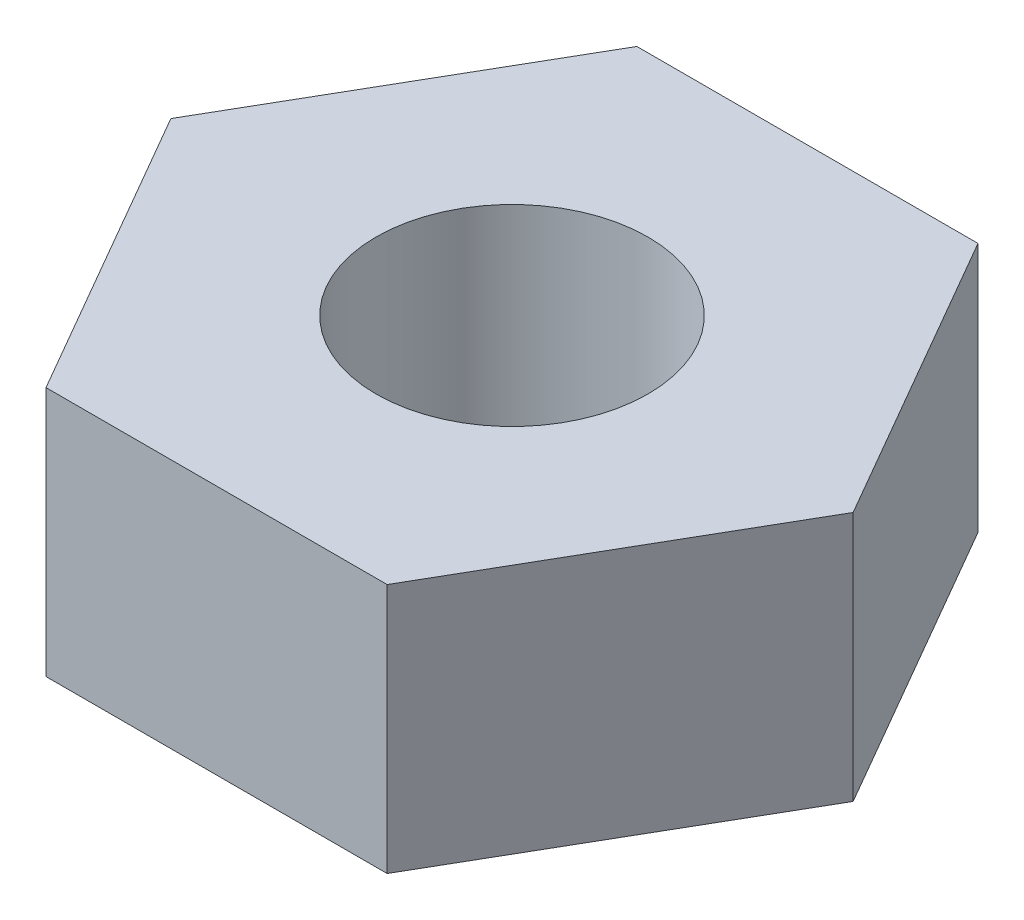
ISO-10303-21;
HEADER;
FILE_DESCRIPTION(('STEP AP214'),'2;1');
FILE_NAME('part.step','',(''),(''),'','','');
FILE_SCHEMA(('AUTOMOTIVE_DESIGN { 1 0 10303 214 1 1 1 1 }'));
ENDSEC;
DATA;
#1=APPLICATION_CONTEXT('core data for automotive mechanical design processes');
#2=APPLICATION_PROTOCOL_DEFINITION('international standard','automotive_design',2000,#1);
#3=PRODUCT_CONTEXT('',#1,'mechanical');
#4=PRODUCT('Part','Part','',(#3));
#5=PRODUCT_RELATED_PRODUCT_CATEGORY('part','',(#4));
#6=PRODUCT_DEFINITION_FORMATION('','',#4);
#7=PRODUCT_DEFINITION_CONTEXT('part definition',#1,'design');
#8=PRODUCT_DEFINITION('design','',#6,#7);
#9=PRODUCT_DEFINITION_SHAPE('','',#8);
#10=(LENGTH_UNIT() NAMED_UNIT(*) SI_UNIT(.MILLI.,.METRE.));
#11=(NAMED_UNIT(*) PLANE_ANGLE_UNIT() SI_UNIT($,.RADIAN.));
#12=(NAMED_UNIT(*) SI_UNIT($,.STERADIAN.) SOLID_ANGLE_UNIT());
#13=UNCERTAINTY_MEASURE_WITH_UNIT(LENGTH_MEASURE(1.E-05),#10,'distance_accuracy_value','');
#14=(GEOMETRIC_REPRESENTATION_CONTEXT(3) GLOBAL_UNCERTAINTY_ASSIGNED_CONTEXT((#13)) GLOBAL_UNIT_ASSIGNED_CONTEXT((#10,
#11,#12)) REPRESENTATION_CONTEXT('',''));
#15=CARTESIAN_POINT('',(0.,0.,0.));
#16=DIRECTION('',(0.,0.,1.));
#17=DIRECTION('',(1.,0.,0.));
#18=AXIS2_PLACEMENT_3D('',#15,#16,#17);
#19=CARTESIAN_POINT('',(0.,2.3,0.));
#20=DIRECTION('',(0.,1.,0.));
#21=DIRECTION('',(0.,0.,1.));
#22=AXIS2_PLACEMENT_3D('',#19,#20,#21);
#23=PLANE('',#22);
#24=DIRECTION('',(0.499999999999995,0.,-0.866025403784442));
#25=VECTOR('',#24,1.);
#26=CARTESIAN_POINT('',(1.56750598084987,2.3,2.71499999999998));
#27=LINE('',#26,#25);
#28=CARTESIAN_POINT('',(1.56750598084987,2.3,2.71499999999998));
#29=VERTEX_POINT('',#28);
#30=CARTESIAN_POINT('',(3.13501196169967,2.3,0.));
#31=VERTEX_POINT('',#30);
#32=EDGE_CURVE('E146',#29,#31,#27,.T.);
#33=ORIENTED_EDGE('',*,*,#32,.T.);
#34=DIRECTION('',(-0.500000000000001,0.,-0.866025403784438));
#35=VECTOR('',#34,1.);
#36=CARTESIAN_POINT('',(3.13501196169967,2.3,0.));
#37=LINE('',#36,#35);
#38=CARTESIAN_POINT('',(1.56750598084983,2.3,-2.71500000000001));
#39=VERTEX_POINT('',#38);
#40=EDGE_CURVE('E94',#31,#39,#37,.T.);
#41=ORIENTED_EDGE('',*,*,#40,.T.);
#42=DIRECTION('',(-1.,0.,0.));
#43=VECTOR('',#42,1.);
#44=CARTESIAN_POINT('',(1.56750598084983,2.3,-2.71500000000001));
#45=LINE('',#44,#43);
#46=CARTESIAN_POINT('',(-1.56750598084985,2.3,-2.715));
#47=VERTEX_POINT('',#46);
#48=EDGE_CURVE('E107',#39,#47,#45,.T.);
#49=ORIENTED_EDGE('',*,*,#48,.T.);
#50=DIRECTION('',(-0.499999999999995,0.,0.866025403784441));
#51=VECTOR('',#50,1.);
#52=CARTESIAN_POINT('',(-1.56750598084985,2.3,-2.715));
#53=LINE('',#52,#51);
#54=CARTESIAN_POINT('',(-3.13501196169967,2.3,0.));
#55=VERTEX_POINT('',#54);
#56=EDGE_CURVE('E101',#47,#55,#53,.T.);
#57=ORIENTED_EDGE('',*,*,#56,.T.);
#58=DIRECTION('',(0.500000000000007,0.,0.866025403784435));
#59=VECTOR('',#58,1.);
#60=CARTESIAN_POINT('',(-3.13501196169967,2.3,0.));
#61=LINE('',#60,#59);
#62=CARTESIAN_POINT('',(-1.56750598084981,2.3,2.71500000000002));
#63=VERTEX_POINT('',#62);
#64=EDGE_CURVE('E105',#55,#63,#61,.T.);
#65=ORIENTED_EDGE('',*,*,#64,.T.);
#66=DIRECTION('',(1.,0.,0.));
#67=VECTOR('',#66,1.);
#68=CARTESIAN_POINT('',(-1.56750598084981,2.3,2.71500000000002));
#69=LINE('',#68,#67);
#70=EDGE_CURVE('E57',#63,#29,#69,.T.);
#71=ORIENTED_EDGE('',*,*,#70,.T.);
#72=EDGE_LOOP('',(#33,#41,#49,#57,#65,#71));
#73=FACE_BOUND('',#72,.T.);
#74=CARTESIAN_POINT('',(0.,2.3,0.));
#75=DIRECTION('',(0.,1.,0.));
#76=DIRECTION('',(0.,0.,1.));
#77=AXIS2_PLACEMENT_3D('',#74,#75,#76);
#78=CIRCLE('',#77,1.25);
#79=CARTESIAN_POINT('',(0.,2.3,1.25));
#80=VERTEX_POINT('',#79);
#81=EDGE_CURVE('E134',#80,#80,#78,.T.);
#82=ORIENTED_EDGE('',*,*,#81,.F.);
#83=EDGE_LOOP('',(#82));
#84=FACE_BOUND('',#83,.T.);
#85=ADVANCED_FACE('F39',(#73,#84),#23,.T.);
#86=CARTESIAN_POINT('',(0.,0.,0.));
#87=DIRECTION('',(0.,1.,0.));
#88=DIRECTION('',(0.,0.,1.));
#89=AXIS2_PLACEMENT_3D('',#86,#87,#88);
#90=PLANE('',#89);
#91=DIRECTION('',(0.499999999999995,0.,-0.866025403784442));
#92=VECTOR('',#91,1.);
#93=CARTESIAN_POINT('',(1.56750598084987,0.,2.71499999999998));
#94=LINE('',#93,#92);
#95=CARTESIAN_POINT('',(1.56750598084987,0.,2.71499999999998));
#96=VERTEX_POINT('',#95);
#97=CARTESIAN_POINT('',(3.13501196169967,0.,0.));
#98=VERTEX_POINT('',#97);
#99=EDGE_CURVE('E129',#96,#98,#94,.T.);
#100=ORIENTED_EDGE('',*,*,#99,.F.);
#101=DIRECTION('',(1.,0.,0.));
#102=VECTOR('',#101,1.);
#103=CARTESIAN_POINT('',(-1.56750598084981,0.,2.71500000000002));
#104=LINE('',#103,#102);
#105=CARTESIAN_POINT('',(-1.56750598084981,0.,2.71500000000002));
#106=VERTEX_POINT('',#105);
#107=EDGE_CURVE('E86',#106,#96,#104,.T.);
#108=ORIENTED_EDGE('',*,*,#107,.F.);
#109=DIRECTION('',(0.500000000000007,0.,0.866025403784435));
#110=VECTOR('',#109,1.);
#111=CARTESIAN_POINT('',(-3.13501196169967,0.,0.));
#112=LINE('',#111,#110);
#113=CARTESIAN_POINT('',(-3.13501196169967,0.,0.));
#114=VERTEX_POINT('',#113);
#115=EDGE_CURVE('E80',#114,#106,#112,.T.);
#116=ORIENTED_EDGE('',*,*,#115,.F.);
#117=DIRECTION('',(-0.499999999999995,0.,0.866025403784441));
#118=VECTOR('',#117,1.);
#119=CARTESIAN_POINT('',(-1.56750598084985,0.,-2.715));
#120=LINE('',#119,#118);
#121=CARTESIAN_POINT('',(-1.56750598084985,0.,-2.715));
#122=VERTEX_POINT('',#121);
#123=EDGE_CURVE('E116',#122,#114,#120,.T.);
#124=ORIENTED_EDGE('',*,*,#123,.F.);
#125=DIRECTION('',(-1.,0.,0.));
#126=VECTOR('',#125,1.);
#127=CARTESIAN_POINT('',(1.56750598084983,0.,-2.71500000000001));
#128=LINE('',#127,#126);
#129=CARTESIAN_POINT('',(1.56750598084983,0.,-2.71500000000001));
#130=VERTEX_POINT('',#129);
#131=EDGE_CURVE('E137',#130,#122,#128,.T.);
#132=ORIENTED_EDGE('',*,*,#131,.F.);
#133=DIRECTION('',(-0.500000000000001,0.,-0.866025403784438));
#134=VECTOR('',#133,1.);
#135=CARTESIAN_POINT('',(3.13501196169967,0.,0.));
#136=LINE('',#135,#134);
#137=EDGE_CURVE('E133',#98,#130,#136,.T.);
#138=ORIENTED_EDGE('',*,*,#137,.F.);
#139=EDGE_LOOP('',(#100,#108,#116,#124,#132,#138));
#140=FACE_BOUND('',#139,.T.);
#141=CARTESIAN_POINT('',(0.,0.,0.));
#142=DIRECTION('',(0.,1.,0.));
#143=DIRECTION('',(0.,0.,1.));
#144=AXIS2_PLACEMENT_3D('',#141,#142,#143);
#145=CIRCLE('',#144,1.25);
#146=CARTESIAN_POINT('',(0.,0.,1.25));
#147=VERTEX_POINT('',#146);
#148=EDGE_CURVE('E243',#147,#147,#145,.T.);
#149=ORIENTED_EDGE('',*,*,#148,.T.);
#150=EDGE_LOOP('',(#149));
#151=FACE_BOUND('',#150,.T.);
#152=ADVANCED_FACE('F159',(#140,#151),#90,.F.);
#153=CARTESIAN_POINT('',(1.56750598084987,2.3,2.71499999999998));
#154=DIRECTION('',(-0.866025403784441,0.,-0.499999999999995));
#155=DIRECTION('',(-0.499999999999995,0.,0.866025403784442));
#156=AXIS2_PLACEMENT_3D('',#153,#154,#155);
#157=PLANE('',#156);
#158=ORIENTED_EDGE('',*,*,#99,.T.);
#159=DIRECTION('',(0.,-1.,0.));
#160=VECTOR('',#159,1.);
#161=CARTESIAN_POINT('',(3.13501196169967,2.3,0.));
#162=LINE('',#161,#160);
#163=EDGE_CURVE('E11',#31,#98,#162,.T.);
#164=ORIENTED_EDGE('',*,*,#163,.F.);
#165=ORIENTED_EDGE('',*,*,#32,.F.);
#166=DIRECTION('',(0.,-1.,0.));
#167=VECTOR('',#166,1.);
#168=CARTESIAN_POINT('',(1.56750598084987,2.3,2.71499999999998));
#169=LINE('',#168,#167);
#170=EDGE_CURVE('E125',#29,#96,#169,.T.);
#171=ORIENTED_EDGE('',*,*,#170,.T.);
#172=EDGE_LOOP('',(#158,#164,#165,#171));
#173=FACE_BOUND('',#172,.T.);
#174=ADVANCED_FACE('F41',(#173),#157,.F.);
#175=CARTESIAN_POINT('',(3.13501196169967,2.3,0.));
#176=DIRECTION('',(-0.866025403784438,0.,0.500000000000001));
#177=DIRECTION('',(0.500000000000001,0.,0.866025403784438));
#178=AXIS2_PLACEMENT_3D('',#175,#176,#177);
#179=PLANE('',#178);
#180=ORIENTED_EDGE('',*,*,#137,.T.);
#181=DIRECTION('',(0.,-1.,0.));
#182=VECTOR('',#181,1.);
#183=CARTESIAN_POINT('',(1.56750598084983,2.3,-2.71500000000001));
#184=LINE('',#183,#182);
#185=EDGE_CURVE('E49',#39,#130,#184,.T.);
#186=ORIENTED_EDGE('',*,*,#185,.F.);
#187=ORIENTED_EDGE('',*,*,#40,.F.);
#188=ORIENTED_EDGE('',*,*,#163,.T.);
#189=EDGE_LOOP('',(#180,#186,#187,#188));
#190=FACE_BOUND('',#189,.T.);
#191=ADVANCED_FACE('F184',(#190),#179,.F.);
#192=CARTESIAN_POINT('',(1.56750598084983,2.3,-2.71500000000001));
#193=DIRECTION('',(0.,0.,1.));
#194=DIRECTION('',(1.,0.,0.));
#195=AXIS2_PLACEMENT_3D('',#192,#193,#194);
#196=PLANE('',#195);
#197=ORIENTED_EDGE('',*,*,#131,.T.);
#198=DIRECTION('',(0.,-1.,0.));
#199=VECTOR('',#198,1.);
#200=CARTESIAN_POINT('',(-1.56750598084985,2.3,-2.715));
#201=LINE('',#200,#199);
#202=EDGE_CURVE('E118',#47,#122,#201,.T.);
#203=ORIENTED_EDGE('',*,*,#202,.F.);
#204=ORIENTED_EDGE('',*,*,#48,.F.);
#205=ORIENTED_EDGE('',*,*,#185,.T.);
#206=EDGE_LOOP('',(#197,#203,#204,#205));
#207=FACE_BOUND('',#206,.T.);
#208=ADVANCED_FACE('F156',(#207),#196,.F.);
#209=CARTESIAN_POINT('',(-1.56750598084985,2.3,-2.715));
#210=DIRECTION('',(0.866025403784442,0.,0.499999999999995));
#211=DIRECTION('',(0.499999999999995,0.,-0.866025403784442));
#212=AXIS2_PLACEMENT_3D('',#209,#210,#211);
#213=PLANE('',#212);
#214=ORIENTED_EDGE('',*,*,#123,.T.);
#215=DIRECTION('',(0.,-1.,0.));
#216=VECTOR('',#215,1.);
#217=CARTESIAN_POINT('',(-3.13501196169967,2.3,0.));
#218=LINE('',#217,#216);
#219=EDGE_CURVE('E113',#55,#114,#218,.T.);
#220=ORIENTED_EDGE('',*,*,#219,.F.);
#221=ORIENTED_EDGE('',*,*,#56,.F.);
#222=ORIENTED_EDGE('',*,*,#202,.T.);
#223=EDGE_LOOP('',(#214,#220,#221,#222));
#224=FACE_BOUND('',#223,.T.);
#225=ADVANCED_FACE('F114',(#224),#213,.F.);
#226=CARTESIAN_POINT('',(-3.13501196169967,2.3,0.));
#227=DIRECTION('',(0.866025403784435,0.,-0.500000000000007));
#228=DIRECTION('',(-0.500000000000007,0.,-0.866025403784435));
#229=AXIS2_PLACEMENT_3D('',#226,#227,#228);
#230=PLANE('',#229);
#231=ORIENTED_EDGE('',*,*,#115,.T.);
#232=DIRECTION('',(0.,-1.,0.));
#233=VECTOR('',#232,1.);
#234=CARTESIAN_POINT('',(-1.56750598084981,2.3,2.71500000000002));
#235=LINE('',#234,#233);
#236=EDGE_CURVE('E119',#63,#106,#235,.T.);
#237=ORIENTED_EDGE('',*,*,#236,.F.);
#238=ORIENTED_EDGE('',*,*,#64,.F.);
#239=ORIENTED_EDGE('',*,*,#219,.T.);
#240=EDGE_LOOP('',(#231,#237,#238,#239));
#241=FACE_BOUND('',#240,.T.);
#242=ADVANCED_FACE('F121',(#241),#230,.F.);
#243=CARTESIAN_POINT('',(-1.56750598084981,2.3,2.71500000000002));
#244=DIRECTION('',(0.,0.,-1.));
#245=DIRECTION('',(-1.,0.,0.));
#246=AXIS2_PLACEMENT_3D('',#243,#244,#245);
#247=PLANE('',#246);
#248=ORIENTED_EDGE('',*,*,#107,.T.);
#249=ORIENTED_EDGE('',*,*,#170,.F.);
#250=ORIENTED_EDGE('',*,*,#70,.F.);
#251=ORIENTED_EDGE('',*,*,#236,.T.);
#252=EDGE_LOOP('',(#248,#249,#250,#251));
#253=FACE_BOUND('',#252,.T.);
#254=ADVANCED_FACE('F164',(#253),#247,.F.);
#255=CARTESIAN_POINT('',(0.,2.3,0.));
#256=DIRECTION('',(0.,-1.,0.));
#257=DIRECTION('',(0.,0.,-1.));
#258=AXIS2_PLACEMENT_3D('',#255,#256,#257);
#259=CYLINDRICAL_SURFACE('',#258,1.25);
#260=ORIENTED_EDGE('',*,*,#81,.T.);
#261=EDGE_LOOP('',(#260));
#262=FACE_BOUND('',#261,.T.);
#263=ORIENTED_EDGE('',*,*,#148,.F.);
#264=EDGE_LOOP('',(#263));
#265=FACE_BOUND('',#264,.T.);
#266=ADVANCED_FACE('F166',(#262,#265),#259,.F.);
#267=CLOSED_SHELL('',(#85,#152,#174,#191,#208,#225,#242,#254,#266));
#268=MANIFOLD_SOLID_BREP('B2',#267);
#269=ADVANCED_BREP_SHAPE_REPRESENTATION('',(#18,#268),#14);
#270=SHAPE_DEFINITION_REPRESENTATION(#9,#269);
ENDSEC;
END-ISO-10303-21;
